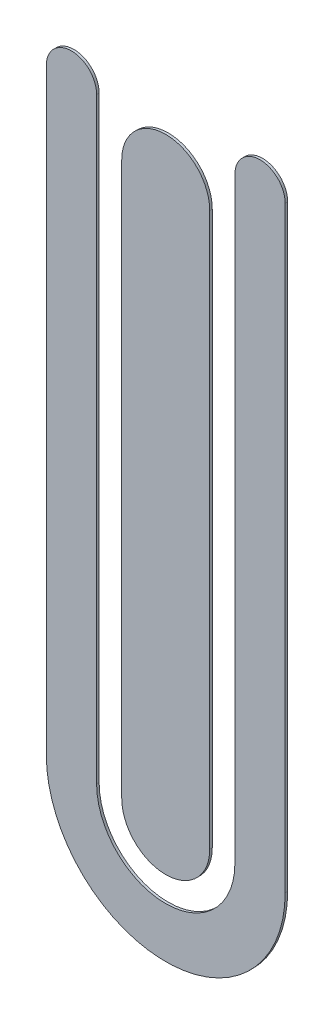
ISO-10303-21;
HEADER;
FILE_DESCRIPTION(('STEP AP214'),'2;1');
FILE_NAME('part.step','',(''),(''),'','','');
FILE_SCHEMA(('AUTOMOTIVE_DESIGN { 1 0 10303 214 1 1 1 1 }'));
ENDSEC;
DATA;
#1=APPLICATION_CONTEXT('core data for automotive mechanical design processes');
#2=APPLICATION_PROTOCOL_DEFINITION('international standard','automotive_design',2000,#1);
#3=PRODUCT_CONTEXT('',#1,'mechanical');
#4=PRODUCT('Part','Part','',(#3));
#5=PRODUCT_RELATED_PRODUCT_CATEGORY('part','',(#4));
#6=PRODUCT_DEFINITION_FORMATION('','',#4);
#7=PRODUCT_DEFINITION_CONTEXT('part definition',#1,'design');
#8=PRODUCT_DEFINITION('design','',#6,#7);
#9=PRODUCT_DEFINITION_SHAPE('','',#8);
#10=(LENGTH_UNIT() NAMED_UNIT(*) SI_UNIT(.MILLI.,.METRE.));
#11=(NAMED_UNIT(*) PLANE_ANGLE_UNIT() SI_UNIT($,.RADIAN.));
#12=(NAMED_UNIT(*) SI_UNIT($,.STERADIAN.) SOLID_ANGLE_UNIT());
#13=UNCERTAINTY_MEASURE_WITH_UNIT(LENGTH_MEASURE(1.E-05),#10,'distance_accuracy_value','');
#14=(GEOMETRIC_REPRESENTATION_CONTEXT(3) GLOBAL_UNCERTAINTY_ASSIGNED_CONTEXT((#13)) GLOBAL_UNIT_ASSIGNED_CONTEXT((#10,
#11,#12)) REPRESENTATION_CONTEXT('',''));
#15=CARTESIAN_POINT('',(0.,0.,0.));
#16=DIRECTION('',(0.,0.,1.));
#17=DIRECTION('',(1.,0.,0.));
#18=AXIS2_PLACEMENT_3D('',#15,#16,#17);
#19=CARTESIAN_POINT('',(7.5,25.5,0.2));
#20=DIRECTION('',(0.,0.,-1.));
#21=DIRECTION('',(-1.,0.,0.));
#22=AXIS2_PLACEMENT_3D('',#19,#20,#21);
#23=CYLINDRICAL_SURFACE('',#22,2.);
#24=CARTESIAN_POINT('',(7.5,25.5,0.));
#25=DIRECTION('',(0.,0.,1.));
#26=DIRECTION('',(1.,0.,0.));
#27=AXIS2_PLACEMENT_3D('',#24,#25,#26);
#28=CIRCLE('',#27,2.);
#29=CARTESIAN_POINT('',(9.5,25.5,0.));
#30=VERTEX_POINT('',#29);
#31=CARTESIAN_POINT('',(5.5,25.5,0.));
#32=VERTEX_POINT('',#31);
#33=EDGE_CURVE('E12',#30,#32,#28,.T.);
#34=ORIENTED_EDGE('',*,*,#33,.T.);
#35=DIRECTION('',(0.,0.,-1.));
#36=VECTOR('',#35,1.);
#37=CARTESIAN_POINT('',(5.5,25.5,0.2));
#38=LINE('',#37,#36);
#39=CARTESIAN_POINT('',(5.5,25.5,0.2));
#40=VERTEX_POINT('',#39);
#41=EDGE_CURVE('E209',#40,#32,#38,.T.);
#42=ORIENTED_EDGE('',*,*,#41,.F.);
#43=CARTESIAN_POINT('',(7.5,25.5,0.2));
#44=DIRECTION('',(0.,0.,1.));
#45=DIRECTION('',(1.,0.,0.));
#46=AXIS2_PLACEMENT_3D('',#43,#44,#45);
#47=CIRCLE('',#46,2.);
#48=CARTESIAN_POINT('',(9.5,25.5,0.2));
#49=VERTEX_POINT('',#48);
#50=EDGE_CURVE('E54',#49,#40,#47,.T.);
#51=ORIENTED_EDGE('',*,*,#50,.F.);
#52=DIRECTION('',(0.,0.,-1.));
#53=VECTOR('',#52,1.);
#54=CARTESIAN_POINT('',(9.5,25.5,0.2));
#55=LINE('',#54,#53);
#56=EDGE_CURVE('E162',#49,#30,#55,.T.);
#57=ORIENTED_EDGE('',*,*,#56,.T.);
#58=EDGE_LOOP('',(#34,#42,#51,#57));
#59=FACE_BOUND('',#58,.T.);
#60=ADVANCED_FACE('F50',(#59),#23,.T.);
#61=CARTESIAN_POINT('',(5.5,25.5,0.2));
#62=DIRECTION('',(1.,0.,0.));
#63=DIRECTION('',(0.,0.,-1.));
#64=AXIS2_PLACEMENT_3D('',#61,#62,#63);
#65=PLANE('',#64);
#66=DIRECTION('',(0.,-1.,0.));
#67=VECTOR('',#66,1.);
#68=CARTESIAN_POINT('',(5.5,25.5,0.));
#69=LINE('',#68,#67);
#70=CARTESIAN_POINT('',(5.5,-22.,0.));
#71=VERTEX_POINT('',#70);
#72=EDGE_CURVE('E61',#32,#71,#69,.T.);
#73=ORIENTED_EDGE('',*,*,#72,.T.);
#74=DIRECTION('',(0.,0.,-1.));
#75=VECTOR('',#74,1.);
#76=CARTESIAN_POINT('',(5.5,-22.,0.2));
#77=LINE('',#76,#75);
#78=CARTESIAN_POINT('',(5.5,-22.,0.2));
#79=VERTEX_POINT('',#78);
#80=EDGE_CURVE('E131',#79,#71,#77,.T.);
#81=ORIENTED_EDGE('',*,*,#80,.F.);
#82=DIRECTION('',(0.,-1.,0.));
#83=VECTOR('',#82,1.);
#84=CARTESIAN_POINT('',(5.5,25.5,0.2));
#85=LINE('',#84,#83);
#86=EDGE_CURVE('E97',#40,#79,#85,.T.);
#87=ORIENTED_EDGE('',*,*,#86,.F.);
#88=ORIENTED_EDGE('',*,*,#41,.T.);
#89=EDGE_LOOP('',(#73,#81,#87,#88));
#90=FACE_BOUND('',#89,.T.);
#91=ADVANCED_FACE('F224',(#90),#65,.F.);
#92=CARTESIAN_POINT('',(0.,-22.,0.2));
#93=DIRECTION('',(0.,0.,-1.));
#94=DIRECTION('',(-1.,0.,0.));
#95=AXIS2_PLACEMENT_3D('',#92,#93,#94);
#96=CYLINDRICAL_SURFACE('',#95,5.5);
#97=CARTESIAN_POINT('',(0.,-22.,0.));
#98=DIRECTION('',(0.,0.,-1.));
#99=DIRECTION('',(1.,0.,0.));
#100=AXIS2_PLACEMENT_3D('',#97,#98,#99);
#101=CIRCLE('',#100,5.5);
#102=CARTESIAN_POINT('',(-5.5,-22.,0.));
#103=VERTEX_POINT('',#102);
#104=EDGE_CURVE('E125',#71,#103,#101,.T.);
#105=ORIENTED_EDGE('',*,*,#104,.T.);
#106=DIRECTION('',(0.,0.,-1.));
#107=VECTOR('',#106,1.);
#108=CARTESIAN_POINT('',(-5.5,-22.,0.2));
#109=LINE('',#108,#107);
#110=CARTESIAN_POINT('',(-5.5,-22.,0.2));
#111=VERTEX_POINT('',#110);
#112=EDGE_CURVE('E129',#111,#103,#109,.T.);
#113=ORIENTED_EDGE('',*,*,#112,.F.);
#114=CARTESIAN_POINT('',(0.,-22.,0.2));
#115=DIRECTION('',(0.,0.,-1.));
#116=DIRECTION('',(1.,0.,0.));
#117=AXIS2_PLACEMENT_3D('',#114,#115,#116);
#118=CIRCLE('',#117,5.5);
#119=EDGE_CURVE('E173',#79,#111,#118,.T.);
#120=ORIENTED_EDGE('',*,*,#119,.F.);
#121=ORIENTED_EDGE('',*,*,#80,.T.);
#122=EDGE_LOOP('',(#105,#113,#120,#121));
#123=FACE_BOUND('',#122,.T.);
#124=ADVANCED_FACE('F127',(#123),#96,.F.);
#125=CARTESIAN_POINT('',(-5.50000000000001,25.5,0.2));
#126=DIRECTION('',(-1.,0.,0.));
#127=DIRECTION('',(0.,-1.,0.));
#128=AXIS2_PLACEMENT_3D('',#125,#126,#127);
#129=PLANE('',#128);
#130=DIRECTION('',(0.,1.,0.));
#131=VECTOR('',#130,1.);
#132=CARTESIAN_POINT('',(-5.50000000000001,25.5,0.));
#133=LINE('',#132,#131);
#134=CARTESIAN_POINT('',(-5.50000000000001,25.5,0.));
#135=VERTEX_POINT('',#134);
#136=EDGE_CURVE('E134',#103,#135,#133,.T.);
#137=ORIENTED_EDGE('',*,*,#136,.T.);
#138=DIRECTION('',(0.,0.,-1.));
#139=VECTOR('',#138,1.);
#140=CARTESIAN_POINT('',(-5.50000000000001,25.5,0.2));
#141=LINE('',#140,#139);
#142=CARTESIAN_POINT('',(-5.50000000000001,25.5,0.2));
#143=VERTEX_POINT('',#142);
#144=EDGE_CURVE('E142',#143,#135,#141,.T.);
#145=ORIENTED_EDGE('',*,*,#144,.F.);
#146=DIRECTION('',(0.,1.,0.));
#147=VECTOR('',#146,1.);
#148=CARTESIAN_POINT('',(-5.50000000000001,25.5,0.2));
#149=LINE('',#148,#147);
#150=EDGE_CURVE('E140',#111,#143,#149,.T.);
#151=ORIENTED_EDGE('',*,*,#150,.F.);
#152=ORIENTED_EDGE('',*,*,#112,.T.);
#153=EDGE_LOOP('',(#137,#145,#151,#152));
#154=FACE_BOUND('',#153,.T.);
#155=ADVANCED_FACE('F137',(#154),#129,.F.);
#156=CARTESIAN_POINT('',(-7.5,25.5,0.2));
#157=DIRECTION('',(0.,0.,-1.));
#158=DIRECTION('',(-1.,0.,0.));
#159=AXIS2_PLACEMENT_3D('',#156,#157,#158);
#160=CYLINDRICAL_SURFACE('',#159,2.);
#161=CARTESIAN_POINT('',(-7.5,25.5,0.));
#162=DIRECTION('',(0.,0.,1.));
#163=DIRECTION('',(1.,0.,0.));
#164=AXIS2_PLACEMENT_3D('',#161,#162,#163);
#165=CIRCLE('',#164,2.);
#166=CARTESIAN_POINT('',(-9.5,25.5,0.));
#167=VERTEX_POINT('',#166);
#168=EDGE_CURVE('E147',#135,#167,#165,.T.);
#169=ORIENTED_EDGE('',*,*,#168,.T.);
#170=DIRECTION('',(0.,0.,-1.));
#171=VECTOR('',#170,1.);
#172=CARTESIAN_POINT('',(-9.5,25.5,0.2));
#173=LINE('',#172,#171);
#174=CARTESIAN_POINT('',(-9.5,25.5,0.2));
#175=VERTEX_POINT('',#174);
#176=EDGE_CURVE('E200',#175,#167,#173,.T.);
#177=ORIENTED_EDGE('',*,*,#176,.F.);
#178=CARTESIAN_POINT('',(-7.5,25.5,0.2));
#179=DIRECTION('',(0.,0.,1.));
#180=DIRECTION('',(1.,0.,0.));
#181=AXIS2_PLACEMENT_3D('',#178,#179,#180);
#182=CIRCLE('',#181,2.);
#183=EDGE_CURVE('E168',#143,#175,#182,.T.);
#184=ORIENTED_EDGE('',*,*,#183,.F.);
#185=ORIENTED_EDGE('',*,*,#144,.T.);
#186=EDGE_LOOP('',(#169,#177,#184,#185));
#187=FACE_BOUND('',#186,.T.);
#188=ADVANCED_FACE('F227',(#187),#160,.T.);
#189=CARTESIAN_POINT('',(-9.5,25.5,0.2));
#190=DIRECTION('',(1.,0.,0.));
#191=DIRECTION('',(0.,0.,-1.));
#192=AXIS2_PLACEMENT_3D('',#189,#190,#191);
#193=PLANE('',#192);
#194=DIRECTION('',(0.,-1.,0.));
#195=VECTOR('',#194,1.);
#196=CARTESIAN_POINT('',(-9.5,25.5,0.));
#197=LINE('',#196,#195);
#198=CARTESIAN_POINT('',(-9.5,-22.,0.));
#199=VERTEX_POINT('',#198);
#200=EDGE_CURVE('E152',#167,#199,#197,.T.);
#201=ORIENTED_EDGE('',*,*,#200,.T.);
#202=DIRECTION('',(0.,0.,-1.));
#203=VECTOR('',#202,1.);
#204=CARTESIAN_POINT('',(-9.5,-22.,0.2));
#205=LINE('',#204,#203);
#206=CARTESIAN_POINT('',(-9.5,-22.,0.2));
#207=VERTEX_POINT('',#206);
#208=EDGE_CURVE('E197',#207,#199,#205,.T.);
#209=ORIENTED_EDGE('',*,*,#208,.F.);
#210=DIRECTION('',(0.,-1.,0.));
#211=VECTOR('',#210,1.);
#212=CARTESIAN_POINT('',(-9.5,25.5,0.2));
#213=LINE('',#212,#211);
#214=EDGE_CURVE('E165',#175,#207,#213,.T.);
#215=ORIENTED_EDGE('',*,*,#214,.F.);
#216=ORIENTED_EDGE('',*,*,#176,.T.);
#217=EDGE_LOOP('',(#201,#209,#215,#216));
#218=FACE_BOUND('',#217,.T.);
#219=ADVANCED_FACE('F195',(#218),#193,.F.);
#220=CARTESIAN_POINT('',(0.,-22.,0.2));
#221=DIRECTION('',(0.,0.,-1.));
#222=DIRECTION('',(-1.,0.,0.));
#223=AXIS2_PLACEMENT_3D('',#220,#221,#222);
#224=CYLINDRICAL_SURFACE('',#223,9.5);
#225=CARTESIAN_POINT('',(0.,-22.,0.));
#226=DIRECTION('',(0.,0.,1.));
#227=DIRECTION('',(1.,0.,0.));
#228=AXIS2_PLACEMENT_3D('',#225,#226,#227);
#229=CIRCLE('',#228,9.5);
#230=CARTESIAN_POINT('',(9.50000000000001,-22.,0.));
#231=VERTEX_POINT('',#230);
#232=EDGE_CURVE('E182',#199,#231,#229,.T.);
#233=ORIENTED_EDGE('',*,*,#232,.T.);
#234=DIRECTION('',(0.,0.,-1.));
#235=VECTOR('',#234,1.);
#236=CARTESIAN_POINT('',(9.50000000000001,-22.,0.2));
#237=LINE('',#236,#235);
#238=CARTESIAN_POINT('',(9.50000000000001,-22.,0.2));
#239=VERTEX_POINT('',#238);
#240=EDGE_CURVE('E206',#239,#231,#237,.T.);
#241=ORIENTED_EDGE('',*,*,#240,.F.);
#242=CARTESIAN_POINT('',(0.,-22.,0.2));
#243=DIRECTION('',(0.,0.,1.));
#244=DIRECTION('',(1.,0.,0.));
#245=AXIS2_PLACEMENT_3D('',#242,#243,#244);
#246=CIRCLE('',#245,9.5);
#247=EDGE_CURVE('E161',#207,#239,#246,.T.);
#248=ORIENTED_EDGE('',*,*,#247,.F.);
#249=ORIENTED_EDGE('',*,*,#208,.T.);
#250=EDGE_LOOP('',(#233,#241,#248,#249));
#251=FACE_BOUND('',#250,.T.);
#252=ADVANCED_FACE('F203',(#251),#224,.T.);
#253=CARTESIAN_POINT('',(9.5,25.5,0.2));
#254=DIRECTION('',(-1.,0.,0.));
#255=DIRECTION('',(0.,-1.,0.));
#256=AXIS2_PLACEMENT_3D('',#253,#254,#255);
#257=PLANE('',#256);
#258=DIRECTION('',(0.,1.,0.));
#259=VECTOR('',#258,1.);
#260=CARTESIAN_POINT('',(9.5,25.5,0.));
#261=LINE('',#260,#259);
#262=EDGE_CURVE('E108',#231,#30,#261,.T.);
#263=ORIENTED_EDGE('',*,*,#262,.T.);
#264=ORIENTED_EDGE('',*,*,#56,.F.);
#265=DIRECTION('',(0.,1.,0.));
#266=VECTOR('',#265,1.);
#267=CARTESIAN_POINT('',(9.5,25.5,0.2));
#268=LINE('',#267,#266);
#269=EDGE_CURVE('E158',#239,#49,#268,.T.);
#270=ORIENTED_EDGE('',*,*,#269,.F.);
#271=ORIENTED_EDGE('',*,*,#240,.T.);
#272=EDGE_LOOP('',(#263,#264,#270,#271));
#273=FACE_BOUND('',#272,.T.);
#274=ADVANCED_FACE('F228',(#273),#257,.F.);
#275=CARTESIAN_POINT('',(7.5,25.5,0.2));
#276=DIRECTION('',(0.,0.,1.));
#277=DIRECTION('',(1.,0.,0.));
#278=AXIS2_PLACEMENT_3D('',#275,#276,#277);
#279=PLANE('',#278);
#280=ORIENTED_EDGE('',*,*,#50,.T.);
#281=ORIENTED_EDGE('',*,*,#86,.T.);
#282=ORIENTED_EDGE('',*,*,#119,.T.);
#283=ORIENTED_EDGE('',*,*,#150,.T.);
#284=ORIENTED_EDGE('',*,*,#183,.T.);
#285=ORIENTED_EDGE('',*,*,#214,.T.);
#286=ORIENTED_EDGE('',*,*,#247,.T.);
#287=ORIENTED_EDGE('',*,*,#269,.T.);
#288=EDGE_LOOP('',(#280,#281,#282,#283,#284,#285,#286,#287));
#289=FACE_BOUND('',#288,.T.);
#290=ADVANCED_FACE('F52',(#289),#279,.T.);
#291=CARTESIAN_POINT('',(7.5,25.5,0.));
#292=DIRECTION('',(0.,0.,1.));
#293=DIRECTION('',(1.,0.,0.));
#294=AXIS2_PLACEMENT_3D('',#291,#292,#293);
#295=PLANE('',#294);
#296=ORIENTED_EDGE('',*,*,#33,.F.);
#297=ORIENTED_EDGE('',*,*,#262,.F.);
#298=ORIENTED_EDGE('',*,*,#232,.F.);
#299=ORIENTED_EDGE('',*,*,#200,.F.);
#300=ORIENTED_EDGE('',*,*,#168,.F.);
#301=ORIENTED_EDGE('',*,*,#136,.F.);
#302=ORIENTED_EDGE('',*,*,#104,.F.);
#303=ORIENTED_EDGE('',*,*,#72,.F.);
#304=EDGE_LOOP('',(#296,#297,#298,#299,#300,#301,#302,#303));
#305=FACE_BOUND('',#304,.T.);
#306=ADVANCED_FACE('F145',(#305),#295,.F.);
#307=CLOSED_SHELL('',(#60,#91,#124,#155,#188,#219,#252,#274,#290,#306));
#308=MANIFOLD_SOLID_BREP('B2',#307);
#309=CARTESIAN_POINT('',(0.,22.,0.2));
#310=DIRECTION('',(0.,0.,-1.));
#311=DIRECTION('',(-1.,0.,0.));
#312=AXIS2_PLACEMENT_3D('',#309,#310,#311);
#313=CYLINDRICAL_SURFACE('',#312,3.5);
#314=CARTESIAN_POINT('',(0.,22.,0.));
#315=DIRECTION('',(0.,0.,1.));
#316=DIRECTION('',(1.,0.,0.));
#317=AXIS2_PLACEMENT_3D('',#314,#315,#316);
#318=CIRCLE('',#317,3.5);
#319=CARTESIAN_POINT('',(3.49999999999999,22.,0.));
#320=VERTEX_POINT('',#319);
#321=CARTESIAN_POINT('',(-3.50000000000001,22.,0.));
#322=VERTEX_POINT('',#321);
#323=EDGE_CURVE('E414',#320,#322,#318,.T.);
#324=ORIENTED_EDGE('',*,*,#323,.T.);
#325=DIRECTION('',(0.,0.,-1.));
#326=VECTOR('',#325,1.);
#327=CARTESIAN_POINT('',(-3.50000000000001,22.,0.2));
#328=LINE('',#327,#326);
#329=CARTESIAN_POINT('',(-3.50000000000001,22.,0.2));
#330=VERTEX_POINT('',#329);
#331=EDGE_CURVE('E48',#330,#322,#328,.T.);
#332=ORIENTED_EDGE('',*,*,#331,.F.);
#333=CARTESIAN_POINT('',(0.,22.,0.2));
#334=DIRECTION('',(0.,0.,1.));
#335=DIRECTION('',(1.,0.,0.));
#336=AXIS2_PLACEMENT_3D('',#333,#334,#335);
#337=CIRCLE('',#336,3.5);
#338=CARTESIAN_POINT('',(3.49999999999999,22.,0.2));
#339=VERTEX_POINT('',#338);
#340=EDGE_CURVE('E397',#339,#330,#337,.T.);
#341=ORIENTED_EDGE('',*,*,#340,.F.);
#342=DIRECTION('',(0.,0.,-1.));
#343=VECTOR('',#342,1.);
#344=CARTESIAN_POINT('',(3.49999999999999,22.,0.2));
#345=LINE('',#344,#343);
#346=EDGE_CURVE('E410',#339,#320,#345,.T.);
#347=ORIENTED_EDGE('',*,*,#346,.T.);
#348=EDGE_LOOP('',(#324,#332,#341,#347));
#349=FACE_BOUND('',#348,.T.);
#350=ADVANCED_FACE('F345',(#349),#313,.T.);
#351=CARTESIAN_POINT('',(-3.50000000000001,22.,0.2));
#352=DIRECTION('',(1.,0.,0.));
#353=DIRECTION('',(0.,1.,0.));
#354=AXIS2_PLACEMENT_3D('',#351,#352,#353);
#355=PLANE('',#354);
#356=DIRECTION('',(0.,-1.,0.));
#357=VECTOR('',#356,1.);
#358=CARTESIAN_POINT('',(-3.50000000000001,22.,0.));
#359=LINE('',#358,#357);
#360=CARTESIAN_POINT('',(-3.5,-22.,0.));
#361=VERTEX_POINT('',#360);
#362=EDGE_CURVE('E402',#322,#361,#359,.T.);
#363=ORIENTED_EDGE('',*,*,#362,.T.);
#364=DIRECTION('',(0.,0.,-1.));
#365=VECTOR('',#364,1.);
#366=CARTESIAN_POINT('',(-3.5,-22.,0.2));
#367=LINE('',#366,#365);
#368=CARTESIAN_POINT('',(-3.5,-22.,0.2));
#369=VERTEX_POINT('',#368);
#370=EDGE_CURVE('E354',#369,#361,#367,.T.);
#371=ORIENTED_EDGE('',*,*,#370,.F.);
#372=DIRECTION('',(0.,-1.,0.));
#373=VECTOR('',#372,1.);
#374=CARTESIAN_POINT('',(-3.50000000000001,22.,0.2));
#375=LINE('',#374,#373);
#376=EDGE_CURVE('E392',#330,#369,#375,.T.);
#377=ORIENTED_EDGE('',*,*,#376,.F.);
#378=ORIENTED_EDGE('',*,*,#331,.T.);
#379=EDGE_LOOP('',(#363,#371,#377,#378));
#380=FACE_BOUND('',#379,.T.);
#381=ADVANCED_FACE('F401',(#380),#355,.F.);
#382=CARTESIAN_POINT('',(0.,-22.,0.2));
#383=DIRECTION('',(0.,0.,-1.));
#384=DIRECTION('',(-1.,0.,0.));
#385=AXIS2_PLACEMENT_3D('',#382,#383,#384);
#386=CYLINDRICAL_SURFACE('',#385,3.5);
#387=CARTESIAN_POINT('',(0.,-22.,0.));
#388=DIRECTION('',(0.,0.,1.));
#389=DIRECTION('',(1.,0.,0.));
#390=AXIS2_PLACEMENT_3D('',#387,#388,#389);
#391=CIRCLE('',#390,3.5);
#392=CARTESIAN_POINT('',(3.5,-22.,0.));
#393=VERTEX_POINT('',#392);
#394=EDGE_CURVE('E379',#361,#393,#391,.T.);
#395=ORIENTED_EDGE('',*,*,#394,.T.);
#396=DIRECTION('',(0.,0.,-1.));
#397=VECTOR('',#396,1.);
#398=CARTESIAN_POINT('',(3.5,-22.,0.2));
#399=LINE('',#398,#397);
#400=CARTESIAN_POINT('',(3.5,-22.,0.2));
#401=VERTEX_POINT('',#400);
#402=EDGE_CURVE('E404',#401,#393,#399,.T.);
#403=ORIENTED_EDGE('',*,*,#402,.F.);
#404=CARTESIAN_POINT('',(0.,-22.,0.2));
#405=DIRECTION('',(0.,0.,1.));
#406=DIRECTION('',(1.,0.,0.));
#407=AXIS2_PLACEMENT_3D('',#404,#405,#406);
#408=CIRCLE('',#407,3.5);
#409=EDGE_CURVE('E395',#369,#401,#408,.T.);
#410=ORIENTED_EDGE('',*,*,#409,.F.);
#411=ORIENTED_EDGE('',*,*,#370,.T.);
#412=EDGE_LOOP('',(#395,#403,#410,#411));
#413=FACE_BOUND('',#412,.T.);
#414=ADVANCED_FACE('F405',(#413),#386,.T.);
#415=CARTESIAN_POINT('',(3.49999999999999,22.,0.2));
#416=DIRECTION('',(-1.,0.,0.));
#417=DIRECTION('',(0.,-1.,0.));
#418=AXIS2_PLACEMENT_3D('',#415,#416,#417);
#419=PLANE('',#418);
#420=DIRECTION('',(0.,1.,0.));
#421=VECTOR('',#420,1.);
#422=CARTESIAN_POINT('',(3.49999999999999,22.,0.));
#423=LINE('',#422,#421);
#424=EDGE_CURVE('E385',#393,#320,#423,.T.);
#425=ORIENTED_EDGE('',*,*,#424,.T.);
#426=ORIENTED_EDGE('',*,*,#346,.F.);
#427=DIRECTION('',(0.,1.,0.));
#428=VECTOR('',#427,1.);
#429=CARTESIAN_POINT('',(3.49999999999999,22.,0.2));
#430=LINE('',#429,#428);
#431=EDGE_CURVE('E362',#401,#339,#430,.T.);
#432=ORIENTED_EDGE('',*,*,#431,.F.);
#433=ORIENTED_EDGE('',*,*,#402,.T.);
#434=EDGE_LOOP('',(#425,#426,#432,#433));
#435=FACE_BOUND('',#434,.T.);
#436=ADVANCED_FACE('F428',(#435),#419,.F.);
#437=CARTESIAN_POINT('',(0.,22.,0.2));
#438=DIRECTION('',(0.,0.,1.));
#439=DIRECTION('',(1.,0.,0.));
#440=AXIS2_PLACEMENT_3D('',#437,#438,#439);
#441=PLANE('',#440);
#442=ORIENTED_EDGE('',*,*,#340,.T.);
#443=ORIENTED_EDGE('',*,*,#376,.T.);
#444=ORIENTED_EDGE('',*,*,#409,.T.);
#445=ORIENTED_EDGE('',*,*,#431,.T.);
#446=EDGE_LOOP('',(#442,#443,#444,#445));
#447=FACE_BOUND('',#446,.T.);
#448=ADVANCED_FACE('F393',(#447),#441,.T.);
#449=CARTESIAN_POINT('',(0.,22.,0.));
#450=DIRECTION('',(0.,0.,1.));
#451=DIRECTION('',(1.,0.,0.));
#452=AXIS2_PLACEMENT_3D('',#449,#450,#451);
#453=PLANE('',#452);
#454=ORIENTED_EDGE('',*,*,#323,.F.);
#455=ORIENTED_EDGE('',*,*,#424,.F.);
#456=ORIENTED_EDGE('',*,*,#394,.F.);
#457=ORIENTED_EDGE('',*,*,#362,.F.);
#458=EDGE_LOOP('',(#454,#455,#456,#457));
#459=FACE_BOUND('',#458,.T.);
#460=ADVANCED_FACE('F431',(#459),#453,.F.);
#461=CLOSED_SHELL('',(#350,#381,#414,#436,#448,#460));
#462=MANIFOLD_SOLID_BREP('B6',#461);
#463=ADVANCED_BREP_SHAPE_REPRESENTATION('',(#18,#308,#462),#14);
#464=SHAPE_DEFINITION_REPRESENTATION(#9,#463);
ENDSEC;
END-ISO-10303-21;
